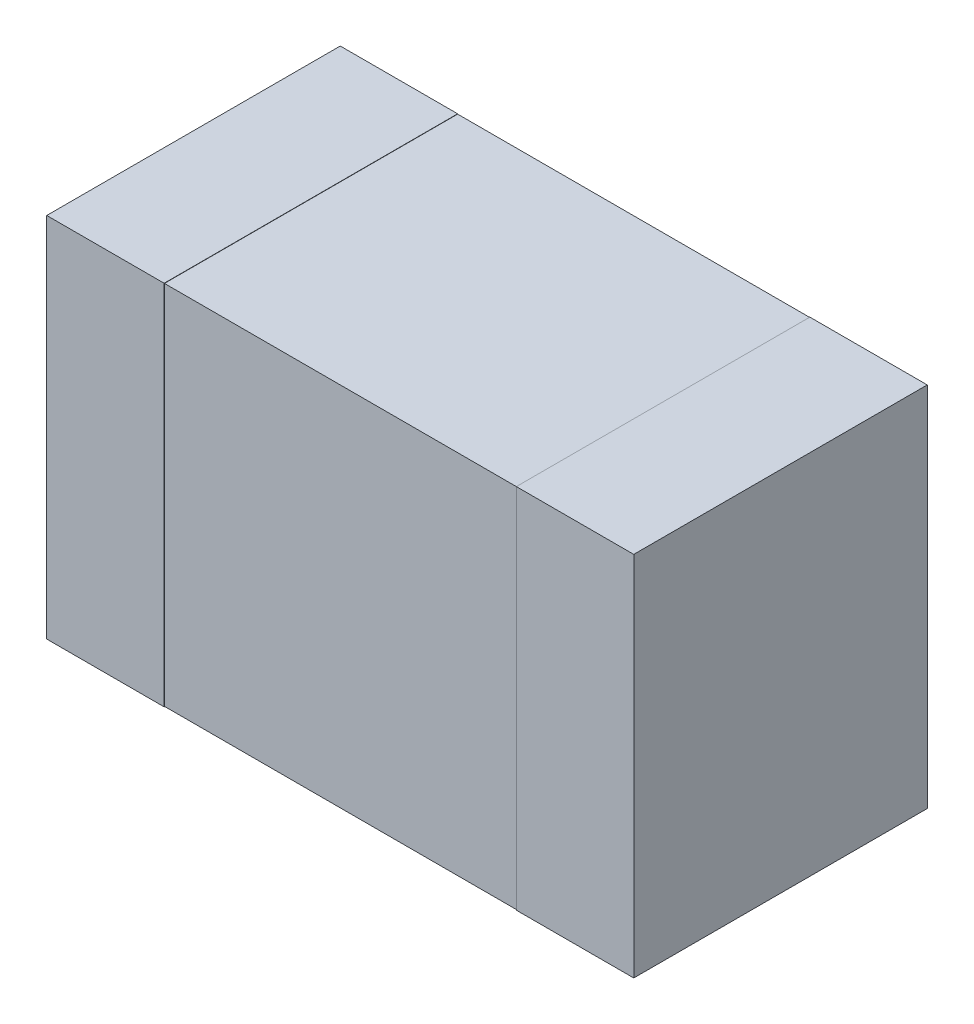
ISO-10303-21;
HEADER;
FILE_DESCRIPTION(('STEP AP214'),'2;1');
FILE_NAME('part.step','',(''),(''),'','','');
FILE_SCHEMA(('AUTOMOTIVE_DESIGN { 1 0 10303 214 1 1 1 1 }'));
ENDSEC;
DATA;
#1=APPLICATION_CONTEXT('core data for automotive mechanical design processes');
#2=APPLICATION_PROTOCOL_DEFINITION('international standard','automotive_design',2000,#1);
#3=PRODUCT_CONTEXT('',#1,'mechanical');
#4=PRODUCT('Part','Part','',(#3));
#5=PRODUCT_RELATED_PRODUCT_CATEGORY('part','',(#4));
#6=PRODUCT_DEFINITION_FORMATION('','',#4);
#7=PRODUCT_DEFINITION_CONTEXT('part definition',#1,'design');
#8=PRODUCT_DEFINITION('design','',#6,#7);
#9=PRODUCT_DEFINITION_SHAPE('','',#8);
#10=(LENGTH_UNIT() NAMED_UNIT(*) SI_UNIT(.MILLI.,.METRE.));
#11=(NAMED_UNIT(*) PLANE_ANGLE_UNIT() SI_UNIT($,.RADIAN.));
#12=(NAMED_UNIT(*) SI_UNIT($,.STERADIAN.) SOLID_ANGLE_UNIT());
#13=UNCERTAINTY_MEASURE_WITH_UNIT(LENGTH_MEASURE(1.E-05),#10,'distance_accuracy_value','');
#14=(GEOMETRIC_REPRESENTATION_CONTEXT(3) GLOBAL_UNCERTAINTY_ASSIGNED_CONTEXT((#13)) GLOBAL_UNIT_ASSIGNED_CONTEXT((#10,
#11,#12)) REPRESENTATION_CONTEXT('',''));
#15=CARTESIAN_POINT('',(0.,0.,0.));
#16=DIRECTION('',(0.,0.,1.));
#17=DIRECTION('',(1.,0.,0.));
#18=AXIS2_PLACEMENT_3D('',#15,#16,#17);
#19=CARTESIAN_POINT('',(0.6,-0.625,0.999));
#20=DIRECTION('',(0.,0.,-1.));
#21=DIRECTION('',(0.,-1.,0.));
#22=AXIS2_PLACEMENT_3D('',#19,#20,#21);
#23=PLANE('',#22);
#24=DIRECTION('',(0.,1.,0.));
#25=VECTOR('',#24,1.);
#26=CARTESIAN_POINT('',(0.6,-0.625,0.999));
#27=LINE('',#26,#25);
#28=CARTESIAN_POINT('',(0.6,-0.624,0.999));
#29=VERTEX_POINT('',#28);
#30=CARTESIAN_POINT('',(0.6,0.624,0.999));
#31=VERTEX_POINT('',#30);
#32=EDGE_CURVE('E164',#29,#31,#27,.T.);
#33=ORIENTED_EDGE('',*,*,#32,.T.);
#34=DIRECTION('',(-1.,0.,0.));
#35=VECTOR('',#34,1.);
#36=CARTESIAN_POINT('',(0.6,0.624,0.999));
#37=LINE('',#36,#35);
#38=CARTESIAN_POINT('',(-0.6,0.624,0.999));
#39=VERTEX_POINT('',#38);
#40=EDGE_CURVE('E190',#31,#39,#37,.T.);
#41=ORIENTED_EDGE('',*,*,#40,.T.);
#42=DIRECTION('',(0.,1.,0.));
#43=VECTOR('',#42,1.);
#44=CARTESIAN_POINT('',(-0.6,-0.625,0.999));
#45=LINE('',#44,#43);
#46=CARTESIAN_POINT('',(-0.6,-0.624,0.999));
#47=VERTEX_POINT('',#46);
#48=EDGE_CURVE('E237',#47,#39,#45,.T.);
#49=ORIENTED_EDGE('',*,*,#48,.F.);
#50=DIRECTION('',(-1.,0.,0.));
#51=VECTOR('',#50,1.);
#52=CARTESIAN_POINT('',(0.6,-0.624,0.999));
#53=LINE('',#52,#51);
#54=EDGE_CURVE('E11',#29,#47,#53,.T.);
#55=ORIENTED_EDGE('',*,*,#54,.F.);
#56=EDGE_LOOP('',(#33,#41,#49,#55));
#57=FACE_BOUND('',#56,.T.);
#58=ADVANCED_FACE('F17',(#57),#23,.F.);
#59=CARTESIAN_POINT('',(0.6,-0.624,1.));
#60=DIRECTION('',(0.,1.,0.));
#61=DIRECTION('',(1.,0.,0.));
#62=AXIS2_PLACEMENT_3D('',#59,#60,#61);
#63=PLANE('',#62);
#64=DIRECTION('',(0.,0.,-1.));
#65=VECTOR('',#64,1.);
#66=CARTESIAN_POINT('',(0.6,-0.624,1.));
#67=LINE('',#66,#65);
#68=CARTESIAN_POINT('',(0.6,-0.624,0.));
#69=VERTEX_POINT('',#68);
#70=EDGE_CURVE('E28',#29,#69,#67,.T.);
#71=ORIENTED_EDGE('',*,*,#70,.F.);
#72=ORIENTED_EDGE('',*,*,#54,.T.);
#73=DIRECTION('',(0.,0.,-1.));
#74=VECTOR('',#73,1.);
#75=CARTESIAN_POINT('',(-0.6,-0.624,1.));
#76=LINE('',#75,#74);
#77=CARTESIAN_POINT('',(-0.6,-0.624,0.));
#78=VERTEX_POINT('',#77);
#79=EDGE_CURVE('E151',#47,#78,#76,.T.);
#80=ORIENTED_EDGE('',*,*,#79,.T.);
#81=DIRECTION('',(1.,0.,0.));
#82=VECTOR('',#81,1.);
#83=CARTESIAN_POINT('',(0.6,-0.624,0.));
#84=LINE('',#83,#82);
#85=EDGE_CURVE('E169',#78,#69,#84,.T.);
#86=ORIENTED_EDGE('',*,*,#85,.T.);
#87=EDGE_LOOP('',(#71,#72,#80,#86));
#88=FACE_BOUND('',#87,.T.);
#89=ADVANCED_FACE('F175',(#88),#63,.F.);
#90=CARTESIAN_POINT('',(0.6,0.625,1.));
#91=DIRECTION('',(1.,0.,0.));
#92=DIRECTION('',(0.,1.,0.));
#93=AXIS2_PLACEMENT_3D('',#90,#91,#92);
#94=PLANE('',#93);
#95=DIRECTION('',(0.,-1.,0.));
#96=VECTOR('',#95,1.);
#97=CARTESIAN_POINT('',(0.6,0.625,0.));
#98=LINE('',#97,#96);
#99=CARTESIAN_POINT('',(0.6,0.625,0.));
#100=VERTEX_POINT('',#99);
#101=CARTESIAN_POINT('',(0.6,0.624,0.));
#102=VERTEX_POINT('',#101);
#103=EDGE_CURVE('E131',#100,#102,#98,.T.);
#104=ORIENTED_EDGE('',*,*,#103,.T.);
#105=DIRECTION('',(0.,0.,-1.));
#106=VECTOR('',#105,1.);
#107=CARTESIAN_POINT('',(0.6,0.624,1.));
#108=LINE('',#107,#106);
#109=EDGE_CURVE('E21',#31,#102,#108,.T.);
#110=ORIENTED_EDGE('',*,*,#109,.F.);
#111=ORIENTED_EDGE('',*,*,#32,.F.);
#112=ORIENTED_EDGE('',*,*,#70,.T.);
#113=DIRECTION('',(2.168404344971E-13,-1.,0.));
#114=VECTOR('',#113,1.);
#115=CARTESIAN_POINT('',(0.6,-0.624,0.));
#116=LINE('',#115,#114);
#117=CARTESIAN_POINT('',(0.6,-0.625,0.));
#118=VERTEX_POINT('',#117);
#119=EDGE_CURVE('E161',#69,#118,#116,.T.);
#120=ORIENTED_EDGE('',*,*,#119,.T.);
#121=DIRECTION('',(0.,0.,-1.));
#122=VECTOR('',#121,1.);
#123=CARTESIAN_POINT('',(0.6,-0.625,1.));
#124=LINE('',#123,#122);
#125=CARTESIAN_POINT('',(0.6,-0.625,1.));
#126=VERTEX_POINT('',#125);
#127=EDGE_CURVE('E197',#126,#118,#124,.T.);
#128=ORIENTED_EDGE('',*,*,#127,.F.);
#129=DIRECTION('',(0.,-1.,0.));
#130=VECTOR('',#129,1.);
#131=CARTESIAN_POINT('',(0.6,0.625,1.));
#132=LINE('',#131,#130);
#133=CARTESIAN_POINT('',(0.6,0.625,1.));
#134=VERTEX_POINT('',#133);
#135=EDGE_CURVE('E178',#134,#126,#132,.T.);
#136=ORIENTED_EDGE('',*,*,#135,.F.);
#137=DIRECTION('',(0.,0.,-1.));
#138=VECTOR('',#137,1.);
#139=CARTESIAN_POINT('',(0.6,0.625,1.));
#140=LINE('',#139,#138);
#141=EDGE_CURVE('E204',#134,#100,#140,.T.);
#142=ORIENTED_EDGE('',*,*,#141,.T.);
#143=EDGE_LOOP('',(#104,#110,#111,#112,#120,#128,#136,#142));
#144=FACE_BOUND('',#143,.T.);
#145=ADVANCED_FACE('F159',(#144),#94,.F.);
#146=CARTESIAN_POINT('',(0.6,0.624,1.));
#147=DIRECTION('',(0.,-1.,0.));
#148=DIRECTION('',(0.,0.,-1.));
#149=AXIS2_PLACEMENT_3D('',#146,#147,#148);
#150=PLANE('',#149);
#151=DIRECTION('',(0.,0.,-1.));
#152=VECTOR('',#151,1.);
#153=CARTESIAN_POINT('',(-0.6,0.624,1.));
#154=LINE('',#153,#152);
#155=CARTESIAN_POINT('',(-0.6,0.624,0.));
#156=VERTEX_POINT('',#155);
#157=EDGE_CURVE('E234',#39,#156,#154,.T.);
#158=ORIENTED_EDGE('',*,*,#157,.F.);
#159=ORIENTED_EDGE('',*,*,#40,.F.);
#160=ORIENTED_EDGE('',*,*,#109,.T.);
#161=DIRECTION('',(-1.,0.,0.));
#162=VECTOR('',#161,1.);
#163=CARTESIAN_POINT('',(0.6,0.624,0.));
#164=LINE('',#163,#162);
#165=EDGE_CURVE('E225',#102,#156,#164,.T.);
#166=ORIENTED_EDGE('',*,*,#165,.T.);
#167=EDGE_LOOP('',(#158,#159,#160,#166));
#168=FACE_BOUND('',#167,.T.);
#169=ADVANCED_FACE('F308',(#168),#150,.F.);
#170=CARTESIAN_POINT('',(-0.6,0.625,1.));
#171=DIRECTION('',(-1.,0.,0.));
#172=DIRECTION('',(0.,0.,1.));
#173=AXIS2_PLACEMENT_3D('',#170,#171,#172);
#174=PLANE('',#173);
#175=DIRECTION('',(0.,1.,0.));
#176=VECTOR('',#175,1.);
#177=CARTESIAN_POINT('',(-0.6,0.625,0.));
#178=LINE('',#177,#176);
#179=CARTESIAN_POINT('',(-0.6,0.625,0.));
#180=VERTEX_POINT('',#179);
#181=EDGE_CURVE('E184',#156,#180,#178,.T.);
#182=ORIENTED_EDGE('',*,*,#181,.T.);
#183=DIRECTION('',(0.,0.,-1.));
#184=VECTOR('',#183,1.);
#185=CARTESIAN_POINT('',(-0.6,0.625,1.));
#186=LINE('',#185,#184);
#187=CARTESIAN_POINT('',(-0.6,0.625,1.));
#188=VERTEX_POINT('',#187);
#189=EDGE_CURVE('E191',#188,#180,#186,.T.);
#190=ORIENTED_EDGE('',*,*,#189,.F.);
#191=DIRECTION('',(0.,1.,0.));
#192=VECTOR('',#191,1.);
#193=CARTESIAN_POINT('',(-0.6,0.625,1.));
#194=LINE('',#193,#192);
#195=CARTESIAN_POINT('',(-0.6,-0.625,1.));
#196=VERTEX_POINT('',#195);
#197=EDGE_CURVE('E198',#196,#188,#194,.T.);
#198=ORIENTED_EDGE('',*,*,#197,.F.);
#199=DIRECTION('',(0.,0.,-1.));
#200=VECTOR('',#199,1.);
#201=CARTESIAN_POINT('',(-0.6,-0.625,1.));
#202=LINE('',#201,#200);
#203=CARTESIAN_POINT('',(-0.6,-0.625,0.));
#204=VERTEX_POINT('',#203);
#205=EDGE_CURVE('E68',#196,#204,#202,.T.);
#206=ORIENTED_EDGE('',*,*,#205,.T.);
#207=DIRECTION('',(-2.168404344971E-13,1.,0.));
#208=VECTOR('',#207,1.);
#209=CARTESIAN_POINT('',(-0.6,-0.624,0.));
#210=LINE('',#209,#208);
#211=EDGE_CURVE('E177',#204,#78,#210,.T.);
#212=ORIENTED_EDGE('',*,*,#211,.T.);
#213=ORIENTED_EDGE('',*,*,#79,.F.);
#214=ORIENTED_EDGE('',*,*,#48,.T.);
#215=ORIENTED_EDGE('',*,*,#157,.T.);
#216=EDGE_LOOP('',(#182,#190,#198,#206,#212,#213,#214,#215));
#217=FACE_BOUND('',#216,.T.);
#218=ADVANCED_FACE('F288',(#217),#174,.F.);
#219=CARTESIAN_POINT('',(0.,0.,0.));
#220=DIRECTION('',(0.,0.,1.));
#221=DIRECTION('',(1.,0.,0.));
#222=AXIS2_PLACEMENT_3D('',#219,#220,#221);
#223=PLANE('',#222);
#224=ORIENTED_EDGE('',*,*,#85,.F.);
#225=ORIENTED_EDGE('',*,*,#211,.F.);
#226=DIRECTION('',(1.,0.,0.));
#227=VECTOR('',#226,1.);
#228=CARTESIAN_POINT('',(-1.,-0.625,0.));
#229=LINE('',#228,#227);
#230=CARTESIAN_POINT('',(-1.,-0.625,0.));
#231=VERTEX_POINT('',#230);
#232=EDGE_CURVE('E218',#231,#204,#229,.T.);
#233=ORIENTED_EDGE('',*,*,#232,.F.);
#234=DIRECTION('',(0.,-1.,0.));
#235=VECTOR('',#234,1.);
#236=CARTESIAN_POINT('',(-1.,0.625,0.));
#237=LINE('',#236,#235);
#238=CARTESIAN_POINT('',(-1.,0.625,0.));
#239=VERTEX_POINT('',#238);
#240=EDGE_CURVE('E243',#239,#231,#237,.T.);
#241=ORIENTED_EDGE('',*,*,#240,.F.);
#242=DIRECTION('',(-1.,0.,0.));
#243=VECTOR('',#242,1.);
#244=CARTESIAN_POINT('',(-1.,0.625,0.));
#245=LINE('',#244,#243);
#246=EDGE_CURVE('E194',#180,#239,#245,.T.);
#247=ORIENTED_EDGE('',*,*,#246,.F.);
#248=ORIENTED_EDGE('',*,*,#181,.F.);
#249=ORIENTED_EDGE('',*,*,#165,.F.);
#250=ORIENTED_EDGE('',*,*,#103,.F.);
#251=DIRECTION('',(-1.,0.,0.));
#252=VECTOR('',#251,1.);
#253=CARTESIAN_POINT('',(-1.,0.625,0.));
#254=LINE('',#253,#252);
#255=CARTESIAN_POINT('',(1.,0.625,0.));
#256=VERTEX_POINT('',#255);
#257=EDGE_CURVE('E208',#256,#100,#254,.T.);
#258=ORIENTED_EDGE('',*,*,#257,.F.);
#259=DIRECTION('',(0.,1.,0.));
#260=VECTOR('',#259,1.);
#261=CARTESIAN_POINT('',(1.,0.625,0.));
#262=LINE('',#261,#260);
#263=CARTESIAN_POINT('',(1.,-0.625,0.));
#264=VERTEX_POINT('',#263);
#265=EDGE_CURVE('E209',#264,#256,#262,.T.);
#266=ORIENTED_EDGE('',*,*,#265,.F.);
#267=DIRECTION('',(1.,0.,0.));
#268=VECTOR('',#267,1.);
#269=CARTESIAN_POINT('',(-1.,-0.625,0.));
#270=LINE('',#269,#268);
#271=EDGE_CURVE('E171',#118,#264,#270,.T.);
#272=ORIENTED_EDGE('',*,*,#271,.F.);
#273=ORIENTED_EDGE('',*,*,#119,.F.);
#274=EDGE_LOOP('',(#224,#225,#233,#241,#247,#248,#249,#250,#258,#266,#272,#273));
#275=FACE_BOUND('',#274,.T.);
#276=ADVANCED_FACE('F19',(#275),#223,.F.);
#277=CARTESIAN_POINT('',(0.,0.,1.));
#278=DIRECTION('',(0.,0.,1.));
#279=DIRECTION('',(1.,0.,0.));
#280=AXIS2_PLACEMENT_3D('',#277,#278,#279);
#281=PLANE('',#280);
#282=ORIENTED_EDGE('',*,*,#135,.T.);
#283=DIRECTION('',(1.,0.,0.));
#284=VECTOR('',#283,1.);
#285=CARTESIAN_POINT('',(-1.,-0.625,1.));
#286=LINE('',#285,#284);
#287=CARTESIAN_POINT('',(1.,-0.625,1.));
#288=VERTEX_POINT('',#287);
#289=EDGE_CURVE('E119',#126,#288,#286,.T.);
#290=ORIENTED_EDGE('',*,*,#289,.T.);
#291=DIRECTION('',(0.,1.,0.));
#292=VECTOR('',#291,1.);
#293=CARTESIAN_POINT('',(1.,0.625,1.));
#294=LINE('',#293,#292);
#295=CARTESIAN_POINT('',(1.,0.625,1.));
#296=VERTEX_POINT('',#295);
#297=EDGE_CURVE('E219',#288,#296,#294,.T.);
#298=ORIENTED_EDGE('',*,*,#297,.T.);
#299=DIRECTION('',(-1.,0.,0.));
#300=VECTOR('',#299,1.);
#301=CARTESIAN_POINT('',(-1.,0.625,1.));
#302=LINE('',#301,#300);
#303=EDGE_CURVE('E207',#296,#134,#302,.T.);
#304=ORIENTED_EDGE('',*,*,#303,.T.);
#305=EDGE_LOOP('',(#282,#290,#298,#304));
#306=FACE_BOUND('',#305,.T.);
#307=ADVANCED_FACE('F305',(#306),#281,.T.);
#308=CARTESIAN_POINT('',(-1.,-0.625,1.));
#309=DIRECTION('',(0.,1.,0.));
#310=DIRECTION('',(1.,0.,0.));
#311=AXIS2_PLACEMENT_3D('',#308,#309,#310);
#312=PLANE('',#311);
#313=ORIENTED_EDGE('',*,*,#289,.F.);
#314=ORIENTED_EDGE('',*,*,#127,.T.);
#315=ORIENTED_EDGE('',*,*,#271,.T.);
#316=DIRECTION('',(0.,0.,-1.));
#317=VECTOR('',#316,1.);
#318=CARTESIAN_POINT('',(1.,-0.625,1.));
#319=LINE('',#318,#317);
#320=EDGE_CURVE('E222',#288,#264,#319,.T.);
#321=ORIENTED_EDGE('',*,*,#320,.F.);
#322=EDGE_LOOP('',(#313,#314,#315,#321));
#323=FACE_BOUND('',#322,.T.);
#324=ADVANCED_FACE('F322',(#323),#312,.F.);
#325=CARTESIAN_POINT('',(-1.,0.625,1.));
#326=DIRECTION('',(1.,0.,0.));
#327=DIRECTION('',(0.,1.,0.));
#328=AXIS2_PLACEMENT_3D('',#325,#326,#327);
#329=PLANE('',#328);
#330=ORIENTED_EDGE('',*,*,#240,.T.);
#331=DIRECTION('',(0.,0.,-1.));
#332=VECTOR('',#331,1.);
#333=CARTESIAN_POINT('',(-1.,-0.625,1.));
#334=LINE('',#333,#332);
#335=CARTESIAN_POINT('',(-1.,-0.625,1.));
#336=VERTEX_POINT('',#335);
#337=EDGE_CURVE('E83',#336,#231,#334,.T.);
#338=ORIENTED_EDGE('',*,*,#337,.F.);
#339=DIRECTION('',(0.,-1.,0.));
#340=VECTOR('',#339,1.);
#341=CARTESIAN_POINT('',(-1.,0.625,1.));
#342=LINE('',#341,#340);
#343=CARTESIAN_POINT('',(-1.,0.625,1.));
#344=VERTEX_POINT('',#343);
#345=EDGE_CURVE('E215',#344,#336,#342,.T.);
#346=ORIENTED_EDGE('',*,*,#345,.F.);
#347=DIRECTION('',(0.,0.,-1.));
#348=VECTOR('',#347,1.);
#349=CARTESIAN_POINT('',(-1.,0.625,1.));
#350=LINE('',#349,#348);
#351=EDGE_CURVE('E213',#344,#239,#350,.T.);
#352=ORIENTED_EDGE('',*,*,#351,.T.);
#353=EDGE_LOOP('',(#330,#338,#346,#352));
#354=FACE_BOUND('',#353,.T.);
#355=ADVANCED_FACE('F268',(#354),#329,.F.);
#356=CARTESIAN_POINT('',(-1.,0.625,1.));
#357=DIRECTION('',(0.,-1.,0.));
#358=DIRECTION('',(0.,0.,-1.));
#359=AXIS2_PLACEMENT_3D('',#356,#357,#358);
#360=PLANE('',#359);
#361=ORIENTED_EDGE('',*,*,#257,.T.);
#362=ORIENTED_EDGE('',*,*,#141,.F.);
#363=ORIENTED_EDGE('',*,*,#303,.F.);
#364=DIRECTION('',(0.,0.,-1.));
#365=VECTOR('',#364,1.);
#366=CARTESIAN_POINT('',(1.,0.625,1.));
#367=LINE('',#366,#365);
#368=EDGE_CURVE('E212',#296,#256,#367,.T.);
#369=ORIENTED_EDGE('',*,*,#368,.T.);
#370=EDGE_LOOP('',(#361,#362,#363,#369));
#371=FACE_BOUND('',#370,.T.);
#372=ADVANCED_FACE('F327',(#371),#360,.F.);
#373=CARTESIAN_POINT('',(1.,0.625,1.));
#374=DIRECTION('',(-1.,0.,0.));
#375=DIRECTION('',(0.,0.,1.));
#376=AXIS2_PLACEMENT_3D('',#373,#374,#375);
#377=PLANE('',#376);
#378=ORIENTED_EDGE('',*,*,#265,.T.);
#379=ORIENTED_EDGE('',*,*,#368,.F.);
#380=ORIENTED_EDGE('',*,*,#297,.F.);
#381=ORIENTED_EDGE('',*,*,#320,.T.);
#382=EDGE_LOOP('',(#378,#379,#380,#381));
#383=FACE_BOUND('',#382,.T.);
#384=ADVANCED_FACE('F325',(#383),#377,.F.);
#385=CARTESIAN_POINT('',(-1.,0.625,1.));
#386=DIRECTION('',(0.,-1.,0.));
#387=DIRECTION('',(0.,0.,-1.));
#388=AXIS2_PLACEMENT_3D('',#385,#386,#387);
#389=PLANE('',#388);
#390=DIRECTION('',(-1.,0.,0.));
#391=VECTOR('',#390,1.);
#392=CARTESIAN_POINT('',(-1.,0.625,1.));
#393=LINE('',#392,#391);
#394=EDGE_CURVE('E202',#188,#344,#393,.T.);
#395=ORIENTED_EDGE('',*,*,#394,.F.);
#396=ORIENTED_EDGE('',*,*,#189,.T.);
#397=ORIENTED_EDGE('',*,*,#246,.T.);
#398=ORIENTED_EDGE('',*,*,#351,.F.);
#399=EDGE_LOOP('',(#395,#396,#397,#398));
#400=FACE_BOUND('',#399,.T.);
#401=ADVANCED_FACE('F272',(#400),#389,.F.);
#402=CARTESIAN_POINT('',(-1.,-0.625,1.));
#403=DIRECTION('',(0.,1.,0.));
#404=DIRECTION('',(1.,0.,0.));
#405=AXIS2_PLACEMENT_3D('',#402,#403,#404);
#406=PLANE('',#405);
#407=ORIENTED_EDGE('',*,*,#232,.T.);
#408=ORIENTED_EDGE('',*,*,#205,.F.);
#409=DIRECTION('',(1.,0.,0.));
#410=VECTOR('',#409,1.);
#411=CARTESIAN_POINT('',(-1.,-0.625,1.));
#412=LINE('',#411,#410);
#413=EDGE_CURVE('E203',#336,#196,#412,.T.);
#414=ORIENTED_EDGE('',*,*,#413,.F.);
#415=ORIENTED_EDGE('',*,*,#337,.T.);
#416=EDGE_LOOP('',(#407,#408,#414,#415));
#417=FACE_BOUND('',#416,.T.);
#418=ADVANCED_FACE('F284',(#417),#406,.F.);
#419=CARTESIAN_POINT('',(0.,0.,1.));
#420=DIRECTION('',(0.,0.,1.));
#421=DIRECTION('',(1.,0.,0.));
#422=AXIS2_PLACEMENT_3D('',#419,#420,#421);
#423=PLANE('',#422);
#424=ORIENTED_EDGE('',*,*,#413,.T.);
#425=ORIENTED_EDGE('',*,*,#197,.T.);
#426=ORIENTED_EDGE('',*,*,#394,.T.);
#427=ORIENTED_EDGE('',*,*,#345,.T.);
#428=EDGE_LOOP('',(#424,#425,#426,#427));
#429=FACE_BOUND('',#428,.T.);
#430=ADVANCED_FACE('F290',(#429),#423,.T.);
#431=CLOSED_SHELL('',(#58,#89,#145,#169,#218,#276,#307,#324,#355,#372,#384,#401,#418,#430));
#432=MANIFOLD_SOLID_BREP('B1',#431);
#433=ADVANCED_BREP_SHAPE_REPRESENTATION('',(#18,#432),#14);
#434=SHAPE_DEFINITION_REPRESENTATION(#9,#433);
ENDSEC;
END-ISO-10303-21;
